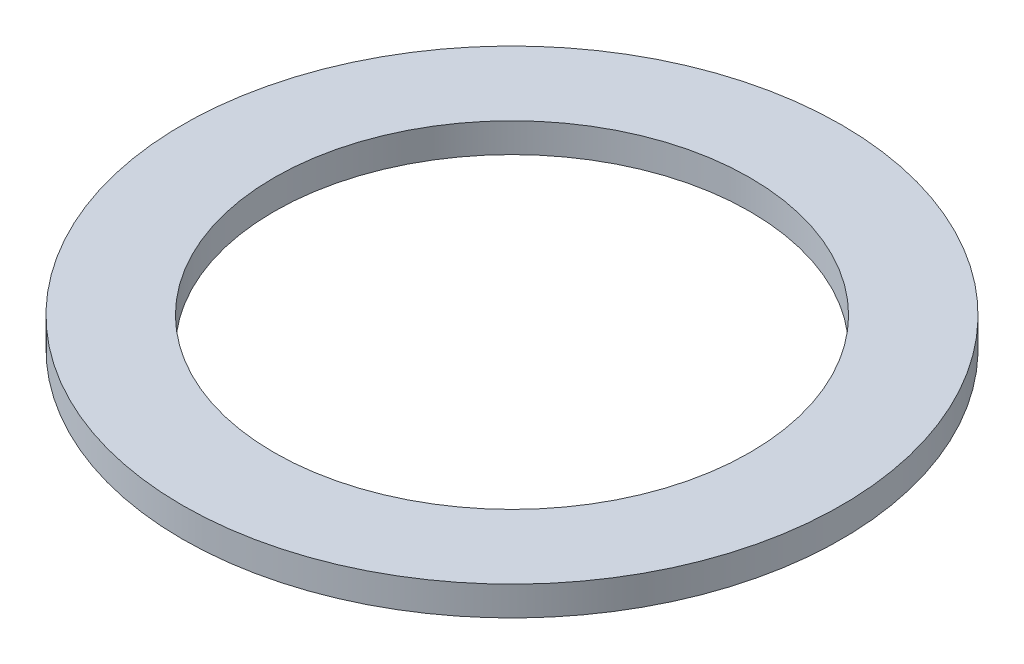
ISO-10303-21;
HEADER;
FILE_DESCRIPTION(('STEP AP214'),'2;1');
FILE_NAME('part.step','',(''),(''),'','','');
FILE_SCHEMA(('AUTOMOTIVE_DESIGN { 1 0 10303 214 1 1 1 1 }'));
ENDSEC;
DATA;
#1=APPLICATION_CONTEXT('core data for automotive mechanical design processes');
#2=APPLICATION_PROTOCOL_DEFINITION('international standard','automotive_design',2000,#1);
#3=PRODUCT_CONTEXT('',#1,'mechanical');
#4=PRODUCT('Part','Part','',(#3));
#5=PRODUCT_RELATED_PRODUCT_CATEGORY('part','',(#4));
#6=PRODUCT_DEFINITION_FORMATION('','',#4);
#7=PRODUCT_DEFINITION_CONTEXT('part definition',#1,'design');
#8=PRODUCT_DEFINITION('design','',#6,#7);
#9=PRODUCT_DEFINITION_SHAPE('','',#8);
#10=(LENGTH_UNIT() NAMED_UNIT(*) SI_UNIT(.MILLI.,.METRE.));
#11=(NAMED_UNIT(*) PLANE_ANGLE_UNIT() SI_UNIT($,.RADIAN.));
#12=(NAMED_UNIT(*) SI_UNIT($,.STERADIAN.) SOLID_ANGLE_UNIT());
#13=UNCERTAINTY_MEASURE_WITH_UNIT(LENGTH_MEASURE(1.E-05),#10,'distance_accuracy_value','');
#14=(GEOMETRIC_REPRESENTATION_CONTEXT(3) GLOBAL_UNCERTAINTY_ASSIGNED_CONTEXT((#13)) GLOBAL_UNIT_ASSIGNED_CONTEXT((#10,
#11,#12)) REPRESENTATION_CONTEXT('',''));
#15=CARTESIAN_POINT('',(0.,0.,0.));
#16=DIRECTION('',(0.,0.,1.));
#17=DIRECTION('',(1.,0.,0.));
#18=AXIS2_PLACEMENT_3D('',#15,#16,#17);
#19=CARTESIAN_POINT('',(0.,4.,0.));
#20=DIRECTION('',(0.,-1.,0.));
#21=DIRECTION('',(0.,0.,-1.));
#22=AXIS2_PLACEMENT_3D('',#19,#20,#21);
#23=CYLINDRICAL_SURFACE('',#22,45.);
#24=CARTESIAN_POINT('',(0.,4.,0.));
#25=DIRECTION('',(0.,1.,0.));
#26=DIRECTION('',(0.,0.,1.));
#27=AXIS2_PLACEMENT_3D('',#24,#25,#26);
#28=CIRCLE('',#27,45.);
#29=CARTESIAN_POINT('',(0.,4.,45.));
#30=VERTEX_POINT('',#29);
#31=EDGE_CURVE('E10',#30,#30,#28,.T.);
#32=ORIENTED_EDGE('',*,*,#31,.F.);
#33=EDGE_LOOP('',(#32));
#34=FACE_BOUND('',#33,.T.);
#35=CARTESIAN_POINT('',(0.,0.,0.));
#36=DIRECTION('',(0.,1.,0.));
#37=DIRECTION('',(0.,0.,1.));
#38=AXIS2_PLACEMENT_3D('',#35,#36,#37);
#39=CIRCLE('',#38,45.);
#40=CARTESIAN_POINT('',(0.,0.,45.));
#41=VERTEX_POINT('',#40);
#42=EDGE_CURVE('E37',#41,#41,#39,.T.);
#43=ORIENTED_EDGE('',*,*,#42,.T.);
#44=EDGE_LOOP('',(#43));
#45=FACE_BOUND('',#44,.T.);
#46=ADVANCED_FACE('F40',(#34,#45),#23,.T.);
#47=CARTESIAN_POINT('',(0.,4.,0.));
#48=DIRECTION('',(0.,1.,0.));
#49=DIRECTION('',(0.,0.,1.));
#50=AXIS2_PLACEMENT_3D('',#47,#48,#49);
#51=PLANE('',#50);
#52=CARTESIAN_POINT('',(0.,4.,0.));
#53=DIRECTION('',(0.,1.,0.));
#54=DIRECTION('',(0.,0.,1.));
#55=AXIS2_PLACEMENT_3D('',#52,#53,#54);
#56=CIRCLE('',#55,32.5);
#57=CARTESIAN_POINT('',(0.,4.,32.5));
#58=VERTEX_POINT('',#57);
#59=EDGE_CURVE('E50',#58,#58,#56,.T.);
#60=ORIENTED_EDGE('',*,*,#59,.F.);
#61=EDGE_LOOP('',(#60));
#62=FACE_BOUND('',#61,.T.);
#63=ORIENTED_EDGE('',*,*,#31,.T.);
#64=EDGE_LOOP('',(#63));
#65=FACE_BOUND('',#64,.T.);
#66=ADVANCED_FACE('F59',(#62,#65),#51,.T.);
#67=CARTESIAN_POINT('',(0.,0.,0.));
#68=DIRECTION('',(0.,1.,0.));
#69=DIRECTION('',(0.,0.,1.));
#70=AXIS2_PLACEMENT_3D('',#67,#68,#69);
#71=PLANE('',#70);
#72=CARTESIAN_POINT('',(0.,0.,0.));
#73=DIRECTION('',(0.,1.,0.));
#74=DIRECTION('',(0.,0.,1.));
#75=AXIS2_PLACEMENT_3D('',#72,#73,#74);
#76=CIRCLE('',#75,32.5);
#77=CARTESIAN_POINT('',(0.,0.,32.5));
#78=VERTEX_POINT('',#77);
#79=EDGE_CURVE('E47',#78,#78,#76,.T.);
#80=ORIENTED_EDGE('',*,*,#79,.T.);
#81=EDGE_LOOP('',(#80));
#82=FACE_BOUND('',#81,.T.);
#83=ORIENTED_EDGE('',*,*,#42,.F.);
#84=EDGE_LOOP('',(#83));
#85=FACE_BOUND('',#84,.T.);
#86=ADVANCED_FACE('F58',(#82,#85),#71,.F.);
#87=CARTESIAN_POINT('',(0.,4.,0.));
#88=DIRECTION('',(0.,-1.,0.));
#89=DIRECTION('',(0.,0.,-1.));
#90=AXIS2_PLACEMENT_3D('',#87,#88,#89);
#91=CYLINDRICAL_SURFACE('',#90,32.5);
#92=ORIENTED_EDGE('',*,*,#59,.T.);
#93=EDGE_LOOP('',(#92));
#94=FACE_BOUND('',#93,.T.);
#95=ORIENTED_EDGE('',*,*,#79,.F.);
#96=EDGE_LOOP('',(#95));
#97=FACE_BOUND('',#96,.T.);
#98=ADVANCED_FACE('F54',(#94,#97),#91,.F.);
#99=CLOSED_SHELL('',(#46,#66,#86,#98));
#100=MANIFOLD_SOLID_BREP('B2',#99);
#101=ADVANCED_BREP_SHAPE_REPRESENTATION('',(#18,#100),#14);
#102=SHAPE_DEFINITION_REPRESENTATION(#9,#101);
ENDSEC;
END-ISO-10303-21;
